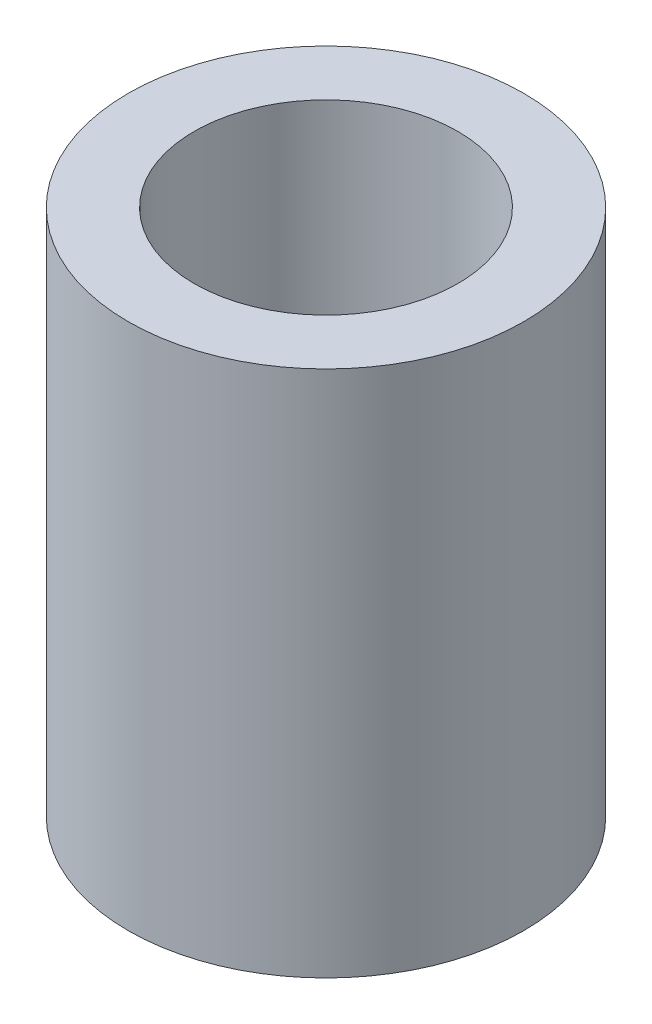
ISO-10303-21;
HEADER;
FILE_DESCRIPTION(('STEP AP214'),'2;1');
FILE_NAME('part.step','',(''),(''),'','','');
FILE_SCHEMA(('AUTOMOTIVE_DESIGN { 1 0 10303 214 1 1 1 1 }'));
ENDSEC;
DATA;
#1=APPLICATION_CONTEXT('core data for automotive mechanical design processes');
#2=APPLICATION_PROTOCOL_DEFINITION('international standard','automotive_design',2000,#1);
#3=PRODUCT_CONTEXT('',#1,'mechanical');
#4=PRODUCT('Part','Part','',(#3));
#5=PRODUCT_RELATED_PRODUCT_CATEGORY('part','',(#4));
#6=PRODUCT_DEFINITION_FORMATION('','',#4);
#7=PRODUCT_DEFINITION_CONTEXT('part definition',#1,'design');
#8=PRODUCT_DEFINITION('design','',#6,#7);
#9=PRODUCT_DEFINITION_SHAPE('','',#8);
#10=(LENGTH_UNIT() NAMED_UNIT(*) SI_UNIT(.MILLI.,.METRE.));
#11=(NAMED_UNIT(*) PLANE_ANGLE_UNIT() SI_UNIT($,.RADIAN.));
#12=(NAMED_UNIT(*) SI_UNIT($,.STERADIAN.) SOLID_ANGLE_UNIT());
#13=UNCERTAINTY_MEASURE_WITH_UNIT(LENGTH_MEASURE(1.E-05),#10,'distance_accuracy_value','');
#14=(GEOMETRIC_REPRESENTATION_CONTEXT(3) GLOBAL_UNCERTAINTY_ASSIGNED_CONTEXT((#13)) GLOBAL_UNIT_ASSIGNED_CONTEXT((#10,
#11,#12)) REPRESENTATION_CONTEXT('',''));
#15=CARTESIAN_POINT('',(0.,0.,0.));
#16=DIRECTION('',(0.,0.,1.));
#17=DIRECTION('',(1.,0.,0.));
#18=AXIS2_PLACEMENT_3D('',#15,#16,#17);
#19=CARTESIAN_POINT('',(0.,12.7,0.));
#20=DIRECTION('',(0.,1.,0.));
#21=DIRECTION('',(0.,0.,1.));
#22=AXIS2_PLACEMENT_3D('',#19,#20,#21);
#23=PLANE('',#22);
#24=CARTESIAN_POINT('',(0.,12.7,0.));
#25=DIRECTION('',(0.,1.,0.));
#26=DIRECTION('',(0.,0.,1.));
#27=AXIS2_PLACEMENT_3D('',#24,#25,#26);
#28=CIRCLE('',#27,4.7625);
#29=CARTESIAN_POINT('',(0.,12.7,4.7625));
#30=VERTEX_POINT('',#29);
#31=EDGE_CURVE('E10',#30,#30,#28,.T.);
#32=ORIENTED_EDGE('',*,*,#31,.T.);
#33=EDGE_LOOP('',(#32));
#34=FACE_BOUND('',#33,.T.);
#35=CARTESIAN_POINT('',(0.,12.7,0.));
#36=DIRECTION('',(0.,1.,0.));
#37=DIRECTION('',(0.,0.,1.));
#38=AXIS2_PLACEMENT_3D('',#35,#36,#37);
#39=CIRCLE('',#38,3.175);
#40=CARTESIAN_POINT('',(0.,12.7,3.175));
#41=VERTEX_POINT('',#40);
#42=EDGE_CURVE('E42',#41,#41,#39,.T.);
#43=ORIENTED_EDGE('',*,*,#42,.F.);
#44=EDGE_LOOP('',(#43));
#45=FACE_BOUND('',#44,.T.);
#46=ADVANCED_FACE('F31',(#34,#45),#23,.T.);
#47=CARTESIAN_POINT('',(0.,0.,0.));
#48=DIRECTION('',(0.,1.,0.));
#49=DIRECTION('',(0.,0.,1.));
#50=AXIS2_PLACEMENT_3D('',#47,#48,#49);
#51=PLANE('',#50);
#52=CARTESIAN_POINT('',(0.,0.,0.));
#53=DIRECTION('',(0.,1.,0.));
#54=DIRECTION('',(0.,0.,1.));
#55=AXIS2_PLACEMENT_3D('',#52,#53,#54);
#56=CIRCLE('',#55,4.7625);
#57=CARTESIAN_POINT('',(0.,0.,4.7625));
#58=VERTEX_POINT('',#57);
#59=EDGE_CURVE('E35',#58,#58,#56,.T.);
#60=ORIENTED_EDGE('',*,*,#59,.F.);
#61=EDGE_LOOP('',(#60));
#62=FACE_BOUND('',#61,.T.);
#63=CARTESIAN_POINT('',(0.,0.,0.));
#64=DIRECTION('',(0.,1.,0.));
#65=DIRECTION('',(0.,0.,1.));
#66=AXIS2_PLACEMENT_3D('',#63,#64,#65);
#67=CIRCLE('',#66,3.175);
#68=CARTESIAN_POINT('',(0.,0.,3.175));
#69=VERTEX_POINT('',#68);
#70=EDGE_CURVE('E44',#69,#69,#67,.T.);
#71=ORIENTED_EDGE('',*,*,#70,.T.);
#72=EDGE_LOOP('',(#71));
#73=FACE_BOUND('',#72,.T.);
#74=ADVANCED_FACE('F54',(#62,#73),#51,.F.);
#75=CARTESIAN_POINT('',(0.,12.7,0.));
#76=DIRECTION('',(0.,-1.,0.));
#77=DIRECTION('',(0.,0.,-1.));
#78=AXIS2_PLACEMENT_3D('',#75,#76,#77);
#79=CYLINDRICAL_SURFACE('',#78,4.7625);
#80=ORIENTED_EDGE('',*,*,#31,.F.);
#81=EDGE_LOOP('',(#80));
#82=FACE_BOUND('',#81,.T.);
#83=ORIENTED_EDGE('',*,*,#59,.T.);
#84=EDGE_LOOP('',(#83));
#85=FACE_BOUND('',#84,.T.);
#86=ADVANCED_FACE('F33',(#82,#85),#79,.T.);
#87=CARTESIAN_POINT('',(0.,12.7,0.));
#88=DIRECTION('',(0.,-1.,0.));
#89=DIRECTION('',(0.,0.,-1.));
#90=AXIS2_PLACEMENT_3D('',#87,#88,#89);
#91=CYLINDRICAL_SURFACE('',#90,3.175);
#92=ORIENTED_EDGE('',*,*,#42,.T.);
#93=EDGE_LOOP('',(#92));
#94=FACE_BOUND('',#93,.T.);
#95=ORIENTED_EDGE('',*,*,#70,.F.);
#96=EDGE_LOOP('',(#95));
#97=FACE_BOUND('',#96,.T.);
#98=ADVANCED_FACE('F50',(#94,#97),#91,.F.);
#99=CLOSED_SHELL('',(#46,#74,#86,#98));
#100=MANIFOLD_SOLID_BREP('B2',#99);
#101=ADVANCED_BREP_SHAPE_REPRESENTATION('',(#18,#100),#14);
#102=SHAPE_DEFINITION_REPRESENTATION(#9,#101);
ENDSEC;
END-ISO-10303-21;
